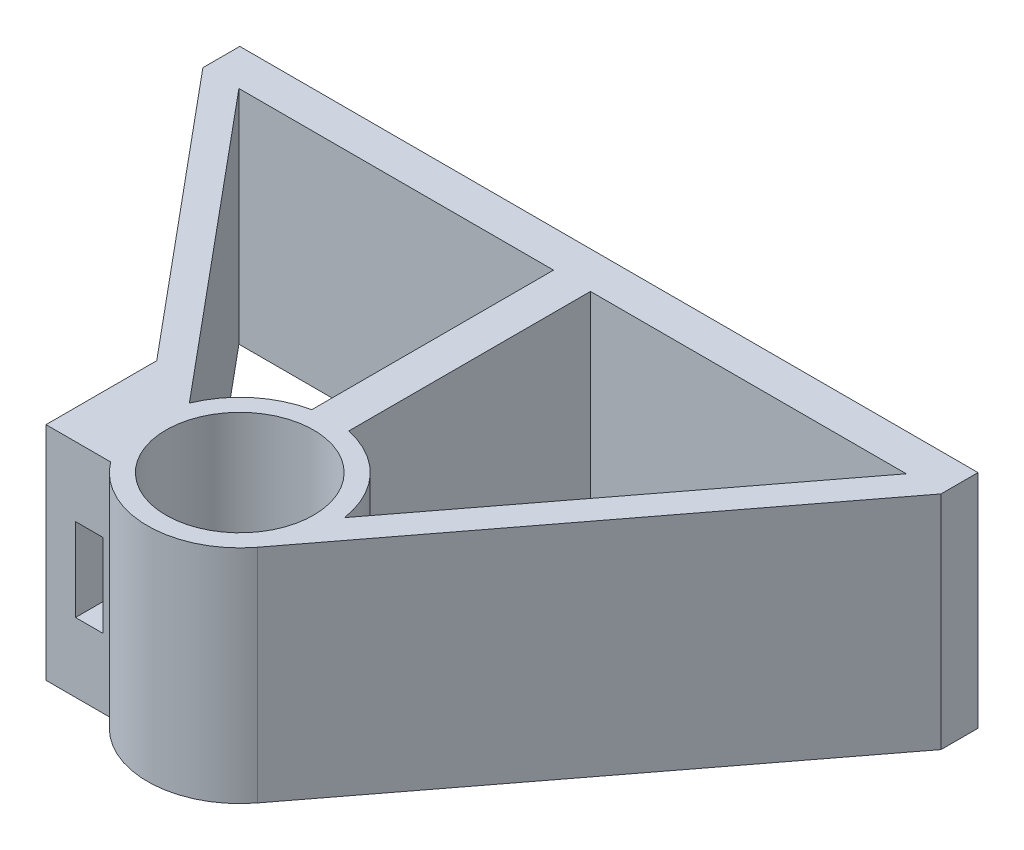
ISO-10303-21;
HEADER;
FILE_DESCRIPTION(('STEP AP214'),'2;1');
FILE_NAME('part.step','',(''),(''),'','','');
FILE_SCHEMA(('AUTOMOTIVE_DESIGN { 1 0 10303 214 1 1 1 1 }'));
ENDSEC;
DATA;
#1=APPLICATION_CONTEXT('core data for automotive mechanical design processes');
#2=APPLICATION_PROTOCOL_DEFINITION('international standard','automotive_design',2000,#1);
#3=PRODUCT_CONTEXT('',#1,'mechanical');
#4=PRODUCT('Part','Part','',(#3));
#5=PRODUCT_RELATED_PRODUCT_CATEGORY('part','',(#4));
#6=PRODUCT_DEFINITION_FORMATION('','',#4);
#7=PRODUCT_DEFINITION_CONTEXT('part definition',#1,'design');
#8=PRODUCT_DEFINITION('design','',#6,#7);
#9=PRODUCT_DEFINITION_SHAPE('','',#8);
#10=(LENGTH_UNIT() NAMED_UNIT(*) SI_UNIT(.MILLI.,.METRE.));
#11=(NAMED_UNIT(*) PLANE_ANGLE_UNIT() SI_UNIT($,.RADIAN.));
#12=(NAMED_UNIT(*) SI_UNIT($,.STERADIAN.) SOLID_ANGLE_UNIT());
#13=UNCERTAINTY_MEASURE_WITH_UNIT(LENGTH_MEASURE(1.E-05),#10,'distance_accuracy_value','');
#14=(GEOMETRIC_REPRESENTATION_CONTEXT(3) GLOBAL_UNCERTAINTY_ASSIGNED_CONTEXT((#13)) GLOBAL_UNIT_ASSIGNED_CONTEXT((#10,
#11,#12)) REPRESENTATION_CONTEXT('',''));
#15=CARTESIAN_POINT('',(0.,0.,0.));
#16=DIRECTION('',(0.,0.,1.));
#17=DIRECTION('',(1.,0.,0.));
#18=AXIS2_PLACEMENT_3D('',#15,#16,#17);
#19=CARTESIAN_POINT('',(-4.,-6.,3.));
#20=DIRECTION('',(0.,0.,1.));
#21=DIRECTION('',(1.,0.,0.));
#22=AXIS2_PLACEMENT_3D('',#19,#20,#21);
#23=PLANE('',#22);
#24=DIRECTION('',(0.,1.,0.));
#25=VECTOR('',#24,1.);
#26=CARTESIAN_POINT('',(-4.,-6.,3.));
#27=LINE('',#26,#25);
#28=CARTESIAN_POINT('',(-4.,-6.,3.));
#29=VERTEX_POINT('',#28);
#30=CARTESIAN_POINT('',(-4.,6.,3.));
#31=VERTEX_POINT('',#30);
#32=EDGE_CURVE('E412',#29,#31,#27,.T.);
#33=ORIENTED_EDGE('',*,*,#32,.T.);
#34=DIRECTION('',(1.,0.,0.));
#35=VECTOR('',#34,1.);
#36=CARTESIAN_POINT('',(-4.,6.,3.));
#37=LINE('',#36,#35);
#38=CARTESIAN_POINT('',(-7.5,6.,3.));
#39=VERTEX_POINT('',#38);
#40=EDGE_CURVE('E284',#39,#31,#37,.T.);
#41=ORIENTED_EDGE('',*,*,#40,.F.);
#42=DIRECTION('',(0.,1.,0.));
#43=VECTOR('',#42,1.);
#44=CARTESIAN_POINT('',(-7.5,-6.,3.));
#45=LINE('',#44,#43);
#46=CARTESIAN_POINT('',(-7.5,-6.,3.));
#47=VERTEX_POINT('',#46);
#48=EDGE_CURVE('E414',#47,#39,#45,.T.);
#49=ORIENTED_EDGE('',*,*,#48,.F.);
#50=DIRECTION('',(1.,0.,0.));
#51=VECTOR('',#50,1.);
#52=CARTESIAN_POINT('',(-4.,-6.,3.));
#53=LINE('',#52,#51);
#54=EDGE_CURVE('E377',#47,#29,#53,.T.);
#55=ORIENTED_EDGE('',*,*,#54,.T.);
#56=EDGE_LOOP('',(#33,#41,#49,#55));
#57=FACE_BOUND('',#56,.T.);
#58=DIRECTION('',(0.,1.,0.));
#59=VECTOR('',#58,1.);
#60=CARTESIAN_POINT('',(-5.9,2.25,3.));
#61=LINE('',#60,#59);
#62=CARTESIAN_POINT('',(-5.9,-2.25,3.));
#63=VERTEX_POINT('',#62);
#64=CARTESIAN_POINT('',(-5.9,2.25,3.));
#65=VERTEX_POINT('',#64);
#66=EDGE_CURVE('E200',#63,#65,#61,.T.);
#67=ORIENTED_EDGE('',*,*,#66,.T.);
#68=DIRECTION('',(1.,0.,0.));
#69=VECTOR('',#68,1.);
#70=CARTESIAN_POINT('',(-4.4,2.25,3.));
#71=LINE('',#70,#69);
#72=CARTESIAN_POINT('',(-4.4,2.25,3.));
#73=VERTEX_POINT('',#72);
#74=EDGE_CURVE('E57',#65,#73,#71,.T.);
#75=ORIENTED_EDGE('',*,*,#74,.T.);
#76=DIRECTION('',(0.,-1.,0.));
#77=VECTOR('',#76,1.);
#78=CARTESIAN_POINT('',(-4.4,-2.25,3.));
#79=LINE('',#78,#77);
#80=CARTESIAN_POINT('',(-4.4,-2.25,3.));
#81=VERTEX_POINT('',#80);
#82=EDGE_CURVE('E194',#73,#81,#79,.T.);
#83=ORIENTED_EDGE('',*,*,#82,.T.);
#84=DIRECTION('',(-1.,0.,0.));
#85=VECTOR('',#84,1.);
#86=CARTESIAN_POINT('',(-4.4,-2.25,3.));
#87=LINE('',#86,#85);
#88=EDGE_CURVE('E209',#81,#63,#87,.T.);
#89=ORIENTED_EDGE('',*,*,#88,.T.);
#90=EDGE_LOOP('',(#67,#75,#83,#89));
#91=FACE_BOUND('',#90,.T.);
#92=ADVANCED_FACE('F39',(#57,#91),#23,.T.);
#93=CARTESIAN_POINT('',(-18.0474375810233,-6.,-18.));
#94=DIRECTION('',(-0.768221279597376,0.,0.64018439966448));
#95=DIRECTION('',(0.64018439966448,0.,0.768221279597376));
#96=AXIS2_PLACEMENT_3D('',#93,#94,#95);
#97=PLANE('',#96);
#98=DIRECTION('',(-0.64018439966448,0.,-0.768221279597376));
#99=VECTOR('',#98,1.);
#100=CARTESIAN_POINT('',(-13.4383238183089,2.25,-12.4690634847426));
#101=LINE('',#100,#99);
#102=CARTESIAN_POINT('',(-4.62685842670751,2.25,-1.89530501482101));
#103=VERTEX_POINT('',#102);
#104=CARTESIAN_POINT('',(-5.9,2.25,-3.423074902772));
#105=VERTEX_POINT('',#104);
#106=EDGE_CURVE('E207',#103,#105,#101,.T.);
#107=ORIENTED_EDGE('',*,*,#106,.T.);
#108=DIRECTION('',(0.,-1.,0.));
#109=VECTOR('',#108,1.);
#110=CARTESIAN_POINT('',(-5.9,2.25,-3.423074902772));
#111=LINE('',#110,#109);
#112=CARTESIAN_POINT('',(-5.9,-2.25,-3.423074902772));
#113=VERTEX_POINT('',#112);
#114=EDGE_CURVE('E198',#105,#113,#111,.T.);
#115=ORIENTED_EDGE('',*,*,#114,.T.);
#116=DIRECTION('',(0.64018439966448,0.,0.768221279597376));
#117=VECTOR('',#116,1.);
#118=CARTESIAN_POINT('',(-13.4383238183089,-2.25,-12.4690634847426));
#119=LINE('',#118,#117);
#120=CARTESIAN_POINT('',(-4.62685842670751,-2.25,-1.89530501482101));
#121=VERTEX_POINT('',#120);
#122=EDGE_CURVE('E183',#113,#121,#119,.T.);
#123=ORIENTED_EDGE('',*,*,#122,.T.);
#124=DIRECTION('',(0.,1.,0.));
#125=VECTOR('',#124,1.);
#126=CARTESIAN_POINT('',(-4.62685842670751,-6.,-1.89530501482101));
#127=LINE('',#126,#125);
#128=CARTESIAN_POINT('',(-4.62685842670751,-6.,-1.89530501482101));
#129=VERTEX_POINT('',#128);
#130=EDGE_CURVE('E363',#129,#121,#127,.T.);
#131=ORIENTED_EDGE('',*,*,#130,.F.);
#132=DIRECTION('',(0.64018439966448,0.,0.768221279597376));
#133=VECTOR('',#132,1.);
#134=CARTESIAN_POINT('',(-18.0474375810233,-6.,-18.));
#135=LINE('',#134,#133);
#136=CARTESIAN_POINT('',(-18.0474375810233,-6.,-18.));
#137=VERTEX_POINT('',#136);
#138=EDGE_CURVE('E328',#137,#129,#135,.T.);
#139=ORIENTED_EDGE('',*,*,#138,.F.);
#140=DIRECTION('',(0.,1.,0.));
#141=VECTOR('',#140,1.);
#142=CARTESIAN_POINT('',(-18.0474375810233,-6.,-18.));
#143=LINE('',#142,#141);
#144=CARTESIAN_POINT('',(-18.0474375810233,6.,-18.));
#145=VERTEX_POINT('',#144);
#146=EDGE_CURVE('E353',#137,#145,#143,.T.);
#147=ORIENTED_EDGE('',*,*,#146,.T.);
#148=DIRECTION('',(0.64018439966448,0.,0.768221279597376));
#149=VECTOR('',#148,1.);
#150=CARTESIAN_POINT('',(-18.0474375810233,6.,-18.));
#151=LINE('',#150,#149);
#152=CARTESIAN_POINT('',(-4.62685842670751,6.,-1.89530501482101));
#153=VERTEX_POINT('',#152);
#154=EDGE_CURVE('E256',#145,#153,#151,.T.);
#155=ORIENTED_EDGE('',*,*,#154,.T.);
#156=EDGE_CURVE('E352',#103,#153,#127,.T.);
#157=ORIENTED_EDGE('',*,*,#156,.F.);
#158=EDGE_LOOP('',(#107,#115,#123,#131,#139,#147,#155,#157));
#159=FACE_BOUND('',#158,.T.);
#160=ADVANCED_FACE('F205',(#159),#97,.F.);
#161=CARTESIAN_POINT('',(0.,-6.,0.));
#162=DIRECTION('',(0.,1.,0.));
#163=DIRECTION('',(0.,0.,1.));
#164=AXIS2_PLACEMENT_3D('',#161,#162,#163);
#165=CYLINDRICAL_SURFACE('',#164,5.);
#166=CARTESIAN_POINT('',(0.,2.25,0.));
#167=DIRECTION('',(0.,-1.,0.));
#168=DIRECTION('',(0.,0.,-1.));
#169=AXIS2_PLACEMENT_3D('',#166,#167,#168);
#170=CIRCLE('',#169,5.);
#171=CARTESIAN_POINT('',(-4.4,2.25,-2.37486841740758));
#172=VERTEX_POINT('',#171);
#173=EDGE_CURVE('E226',#172,#103,#170,.F.);
#174=ORIENTED_EDGE('',*,*,#173,.T.);
#175=ORIENTED_EDGE('',*,*,#156,.T.);
#176=CARTESIAN_POINT('',(0.,6.,0.));
#177=DIRECTION('',(0.,-1.,0.));
#178=DIRECTION('',(0.,0.,1.));
#179=AXIS2_PLACEMENT_3D('',#176,#177,#178);
#180=CIRCLE('',#179,5.);
#181=CARTESIAN_POINT('',(-0.999999999999997,6.,-4.89897948556636));
#182=VERTEX_POINT('',#181);
#183=EDGE_CURVE('E260',#153,#182,#180,.T.);
#184=ORIENTED_EDGE('',*,*,#183,.T.);
#185=DIRECTION('',(0.,1.,0.));
#186=VECTOR('',#185,1.);
#187=CARTESIAN_POINT('',(-0.999999999999997,-6.,-4.89897948556636));
#188=LINE('',#187,#186);
#189=CARTESIAN_POINT('',(-0.999999999999996,-6.,-4.89897948556636));
#190=VERTEX_POINT('',#189);
#191=EDGE_CURVE('E360',#190,#182,#188,.T.);
#192=ORIENTED_EDGE('',*,*,#191,.F.);
#193=CARTESIAN_POINT('',(0.,-6.,0.));
#194=DIRECTION('',(0.,-1.,0.));
#195=DIRECTION('',(0.,0.,1.));
#196=AXIS2_PLACEMENT_3D('',#193,#194,#195);
#197=CIRCLE('',#196,5.);
#198=EDGE_CURVE('E340',#129,#190,#197,.T.);
#199=ORIENTED_EDGE('',*,*,#198,.F.);
#200=ORIENTED_EDGE('',*,*,#130,.T.);
#201=CARTESIAN_POINT('',(0.,-2.25,0.));
#202=DIRECTION('',(0.,1.,0.));
#203=DIRECTION('',(0.,0.,1.));
#204=AXIS2_PLACEMENT_3D('',#201,#202,#203);
#205=CIRCLE('',#204,5.);
#206=CARTESIAN_POINT('',(-4.4,-2.25,-2.37486841740758));
#207=VERTEX_POINT('',#206);
#208=EDGE_CURVE('E189',#121,#207,#205,.F.);
#209=ORIENTED_EDGE('',*,*,#208,.T.);
#210=DIRECTION('',(0.,1.,0.));
#211=VECTOR('',#210,1.);
#212=CARTESIAN_POINT('',(-4.4,-6.,-2.37486841740758));
#213=LINE('',#212,#211);
#214=EDGE_CURVE('E224',#207,#172,#213,.T.);
#215=ORIENTED_EDGE('',*,*,#214,.T.);
#216=EDGE_LOOP('',(#174,#175,#184,#192,#199,#200,#209,#215));
#217=FACE_BOUND('',#216,.T.);
#218=ADVANCED_FACE('F466',(#217),#165,.T.);
#219=CARTESIAN_POINT('',(-20.,-6.,-18.));
#220=DIRECTION('',(-0.768221279597376,0.,0.64018439966448));
#221=DIRECTION('',(0.64018439966448,0.,0.768221279597376));
#222=AXIS2_PLACEMENT_3D('',#219,#220,#221);
#223=PLANE('',#222);
#224=DIRECTION('',(0.,1.,0.));
#225=VECTOR('',#224,1.);
#226=CARTESIAN_POINT('',(-7.5,-6.,-3.));
#227=LINE('',#226,#225);
#228=CARTESIAN_POINT('',(-7.5,-6.,-3.));
#229=VERTEX_POINT('',#228);
#230=CARTESIAN_POINT('',(-7.5,6.,-3.));
#231=VERTEX_POINT('',#230);
#232=EDGE_CURVE('E43',#229,#231,#227,.T.);
#233=ORIENTED_EDGE('',*,*,#232,.T.);
#234=DIRECTION('',(0.64018439966448,0.,0.768221279597376));
#235=VECTOR('',#234,1.);
#236=CARTESIAN_POINT('',(-20.,6.,-18.));
#237=LINE('',#236,#235);
#238=CARTESIAN_POINT('',(-20.,6.,-18.));
#239=VERTEX_POINT('',#238);
#240=EDGE_CURVE('E276',#239,#231,#237,.T.);
#241=ORIENTED_EDGE('',*,*,#240,.F.);
#242=DIRECTION('',(0.,1.,0.));
#243=VECTOR('',#242,1.);
#244=CARTESIAN_POINT('',(-20.,-6.,-18.));
#245=LINE('',#244,#243);
#246=CARTESIAN_POINT('',(-20.,-6.,-18.));
#247=VERTEX_POINT('',#246);
#248=EDGE_CURVE('E11',#247,#239,#245,.T.);
#249=ORIENTED_EDGE('',*,*,#248,.F.);
#250=DIRECTION('',(0.64018439966448,0.,0.768221279597376));
#251=VECTOR('',#250,1.);
#252=CARTESIAN_POINT('',(-20.,-6.,-18.));
#253=LINE('',#252,#251);
#254=EDGE_CURVE('E369',#247,#229,#253,.T.);
#255=ORIENTED_EDGE('',*,*,#254,.T.);
#256=EDGE_LOOP('',(#233,#241,#249,#255));
#257=FACE_BOUND('',#256,.T.);
#258=ADVANCED_FACE('F41',(#257),#223,.T.);
#259=CARTESIAN_POINT('',(-20.,-6.,-20.));
#260=DIRECTION('',(-1.,0.,0.));
#261=DIRECTION('',(0.,0.,1.));
#262=AXIS2_PLACEMENT_3D('',#259,#260,#261);
#263=PLANE('',#262);
#264=ORIENTED_EDGE('',*,*,#248,.T.);
#265=DIRECTION('',(0.,0.,1.));
#266=VECTOR('',#265,1.);
#267=CARTESIAN_POINT('',(-20.,6.,-20.));
#268=LINE('',#267,#266);
#269=CARTESIAN_POINT('',(-20.,6.,-20.));
#270=VERTEX_POINT('',#269);
#271=EDGE_CURVE('E304',#270,#239,#268,.T.);
#272=ORIENTED_EDGE('',*,*,#271,.F.);
#273=DIRECTION('',(0.,1.,0.));
#274=VECTOR('',#273,1.);
#275=CARTESIAN_POINT('',(-20.,-6.,-20.));
#276=LINE('',#275,#274);
#277=CARTESIAN_POINT('',(-20.,-6.,-20.));
#278=VERTEX_POINT('',#277);
#279=EDGE_CURVE('E49',#278,#270,#276,.T.);
#280=ORIENTED_EDGE('',*,*,#279,.F.);
#281=DIRECTION('',(0.,0.,1.));
#282=VECTOR('',#281,1.);
#283=CARTESIAN_POINT('',(-20.,-6.,-20.));
#284=LINE('',#283,#282);
#285=EDGE_CURVE('E397',#278,#247,#284,.T.);
#286=ORIENTED_EDGE('',*,*,#285,.T.);
#287=EDGE_LOOP('',(#264,#272,#280,#286));
#288=FACE_BOUND('',#287,.T.);
#289=ADVANCED_FACE('F431',(#288),#263,.T.);
#290=CARTESIAN_POINT('',(20.,-6.,-20.));
#291=DIRECTION('',(0.,0.,-1.));
#292=DIRECTION('',(-1.,0.,0.));
#293=AXIS2_PLACEMENT_3D('',#290,#291,#292);
#294=PLANE('',#293);
#295=ORIENTED_EDGE('',*,*,#279,.T.);
#296=DIRECTION('',(-1.,0.,0.));
#297=VECTOR('',#296,1.);
#298=CARTESIAN_POINT('',(20.,6.,-20.));
#299=LINE('',#298,#297);
#300=CARTESIAN_POINT('',(20.,6.,-20.));
#301=VERTEX_POINT('',#300);
#302=EDGE_CURVE('E300',#301,#270,#299,.T.);
#303=ORIENTED_EDGE('',*,*,#302,.F.);
#304=DIRECTION('',(0.,1.,0.));
#305=VECTOR('',#304,1.);
#306=CARTESIAN_POINT('',(20.,-6.,-20.));
#307=LINE('',#306,#305);
#308=CARTESIAN_POINT('',(20.,-6.,-20.));
#309=VERTEX_POINT('',#308);
#310=EDGE_CURVE('E403',#309,#301,#307,.T.);
#311=ORIENTED_EDGE('',*,*,#310,.F.);
#312=DIRECTION('',(-1.,0.,0.));
#313=VECTOR('',#312,1.);
#314=CARTESIAN_POINT('',(20.,-6.,-20.));
#315=LINE('',#314,#313);
#316=EDGE_CURVE('E393',#309,#278,#315,.T.);
#317=ORIENTED_EDGE('',*,*,#316,.T.);
#318=EDGE_LOOP('',(#295,#303,#311,#317));
#319=FACE_BOUND('',#318,.T.);
#320=ADVANCED_FACE('F452',(#319),#294,.T.);
#321=CARTESIAN_POINT('',(20.,-6.,-20.));
#322=DIRECTION('',(1.,0.,0.));
#323=DIRECTION('',(0.,0.,-1.));
#324=AXIS2_PLACEMENT_3D('',#321,#322,#323);
#325=PLANE('',#324);
#326=ORIENTED_EDGE('',*,*,#310,.T.);
#327=DIRECTION('',(0.,0.,-1.));
#328=VECTOR('',#327,1.);
#329=CARTESIAN_POINT('',(20.,6.,-20.));
#330=LINE('',#329,#328);
#331=CARTESIAN_POINT('',(20.,6.,-18.));
#332=VERTEX_POINT('',#331);
#333=EDGE_CURVE('E296',#332,#301,#330,.T.);
#334=ORIENTED_EDGE('',*,*,#333,.F.);
#335=DIRECTION('',(0.,1.,0.));
#336=VECTOR('',#335,1.);
#337=CARTESIAN_POINT('',(20.,-6.,-18.));
#338=LINE('',#337,#336);
#339=CARTESIAN_POINT('',(20.,-6.,-18.));
#340=VERTEX_POINT('',#339);
#341=EDGE_CURVE('E406',#340,#332,#338,.T.);
#342=ORIENTED_EDGE('',*,*,#341,.F.);
#343=DIRECTION('',(0.,0.,-1.));
#344=VECTOR('',#343,1.);
#345=CARTESIAN_POINT('',(20.,-6.,-20.));
#346=LINE('',#345,#344);
#347=EDGE_CURVE('E389',#340,#309,#346,.T.);
#348=ORIENTED_EDGE('',*,*,#347,.T.);
#349=EDGE_LOOP('',(#326,#334,#342,#348));
#350=FACE_BOUND('',#349,.T.);
#351=ADVANCED_FACE('F449',(#350),#325,.T.);
#352=CARTESIAN_POINT('',(20.,-6.,-18.));
#353=DIRECTION('',(0.795435008826633,0.,0.606038898696259));
#354=DIRECTION('',(0.606038898696259,0.,-0.795435008826633));
#355=AXIS2_PLACEMENT_3D('',#352,#353,#354);
#356=PLANE('',#355);
#357=ORIENTED_EDGE('',*,*,#341,.T.);
#358=DIRECTION('',(0.606038898696259,0.,-0.795435008826633));
#359=VECTOR('',#358,1.);
#360=CARTESIAN_POINT('',(20.,6.,-18.));
#361=LINE('',#360,#359);
#362=CARTESIAN_POINT('',(3.97717504413316,6.,3.03019449348129));
#363=VERTEX_POINT('',#362);
#364=EDGE_CURVE('E292',#363,#332,#361,.T.);
#365=ORIENTED_EDGE('',*,*,#364,.F.);
#366=DIRECTION('',(0.,1.,0.));
#367=VECTOR('',#366,1.);
#368=CARTESIAN_POINT('',(3.97717504413316,-6.,3.03019449348129));
#369=LINE('',#368,#367);
#370=CARTESIAN_POINT('',(3.97717504413316,-6.,3.03019449348129));
#371=VERTEX_POINT('',#370);
#372=EDGE_CURVE('E409',#371,#363,#369,.T.);
#373=ORIENTED_EDGE('',*,*,#372,.F.);
#374=DIRECTION('',(0.606038898696259,0.,-0.795435008826633));
#375=VECTOR('',#374,1.);
#376=CARTESIAN_POINT('',(20.,-6.,-18.));
#377=LINE('',#376,#375);
#378=EDGE_CURVE('E385',#371,#340,#377,.T.);
#379=ORIENTED_EDGE('',*,*,#378,.T.);
#380=EDGE_LOOP('',(#357,#365,#373,#379));
#381=FACE_BOUND('',#380,.T.);
#382=ADVANCED_FACE('F446',(#381),#356,.T.);
#383=CARTESIAN_POINT('',(0.,-6.,0.));
#384=DIRECTION('',(0.,1.,0.));
#385=DIRECTION('',(0.,0.,1.));
#386=AXIS2_PLACEMENT_3D('',#383,#384,#385);
#387=CYLINDRICAL_SURFACE('',#386,5.);
#388=ORIENTED_EDGE('',*,*,#372,.T.);
#389=CARTESIAN_POINT('',(0.,6.,0.));
#390=DIRECTION('',(0.,1.,0.));
#391=DIRECTION('',(0.,0.,1.));
#392=AXIS2_PLACEMENT_3D('',#389,#390,#391);
#393=CIRCLE('',#392,5.);
#394=EDGE_CURVE('E288',#31,#363,#393,.T.);
#395=ORIENTED_EDGE('',*,*,#394,.F.);
#396=ORIENTED_EDGE('',*,*,#32,.F.);
#397=CARTESIAN_POINT('',(0.,-6.,0.));
#398=DIRECTION('',(0.,1.,0.));
#399=DIRECTION('',(0.,0.,1.));
#400=AXIS2_PLACEMENT_3D('',#397,#398,#399);
#401=CIRCLE('',#400,5.);
#402=EDGE_CURVE('E381',#29,#371,#401,.T.);
#403=ORIENTED_EDGE('',*,*,#402,.T.);
#404=EDGE_LOOP('',(#388,#395,#396,#403));
#405=FACE_BOUND('',#404,.T.);
#406=ADVANCED_FACE('F444',(#405),#387,.T.);
#407=CARTESIAN_POINT('',(-7.5,-6.,-3.));
#408=DIRECTION('',(-1.,0.,0.));
#409=DIRECTION('',(0.,0.,1.));
#410=AXIS2_PLACEMENT_3D('',#407,#408,#409);
#411=PLANE('',#410);
#412=ORIENTED_EDGE('',*,*,#48,.T.);
#413=DIRECTION('',(0.,0.,1.));
#414=VECTOR('',#413,1.);
#415=CARTESIAN_POINT('',(-7.5,6.,-3.));
#416=LINE('',#415,#414);
#417=EDGE_CURVE('E280',#231,#39,#416,.T.);
#418=ORIENTED_EDGE('',*,*,#417,.F.);
#419=ORIENTED_EDGE('',*,*,#232,.F.);
#420=DIRECTION('',(0.,0.,1.));
#421=VECTOR('',#420,1.);
#422=CARTESIAN_POINT('',(-7.5,-6.,-3.));
#423=LINE('',#422,#421);
#424=EDGE_CURVE('E373',#229,#47,#423,.T.);
#425=ORIENTED_EDGE('',*,*,#424,.T.);
#426=EDGE_LOOP('',(#412,#418,#419,#425));
#427=FACE_BOUND('',#426,.T.);
#428=ADVANCED_FACE('F423',(#427),#411,.T.);
#429=CARTESIAN_POINT('',(0.,-6.,0.));
#430=DIRECTION('',(0.,1.,0.));
#431=DIRECTION('',(0.,0.,1.));
#432=AXIS2_PLACEMENT_3D('',#429,#430,#431);
#433=PLANE('',#432);
#434=DIRECTION('',(0.,0.,1.));
#435=VECTOR('',#434,1.);
#436=CARTESIAN_POINT('',(1.,-6.,-4.89897948556636));
#437=LINE('',#436,#435);
#438=CARTESIAN_POINT('',(1.,-6.,-18.));
#439=VERTEX_POINT('',#438);
#440=CARTESIAN_POINT('',(1.,-6.,-4.89897948556636));
#441=VERTEX_POINT('',#440);
#442=EDGE_CURVE('E320',#439,#441,#437,.T.);
#443=ORIENTED_EDGE('',*,*,#442,.T.);
#444=CARTESIAN_POINT('',(0.,-6.,0.));
#445=DIRECTION('',(0.,-1.,0.));
#446=DIRECTION('',(0.,0.,1.));
#447=AXIS2_PLACEMENT_3D('',#444,#445,#446);
#448=CIRCLE('',#447,5.);
#449=CARTESIAN_POINT('',(4.94801424086935,-6.,-0.719134947109471));
#450=VERTEX_POINT('',#449);
#451=EDGE_CURVE('E308',#441,#450,#448,.T.);
#452=ORIENTED_EDGE('',*,*,#451,.T.);
#453=DIRECTION('',(0.606038898696259,0.,-0.795435008826633));
#454=VECTOR('',#453,1.);
#455=CARTESIAN_POINT('',(18.1142393993789,-6.,-18.));
#456=LINE('',#455,#454);
#457=CARTESIAN_POINT('',(18.1142393993789,-6.,-18.));
#458=VERTEX_POINT('',#457);
#459=EDGE_CURVE('E312',#450,#458,#456,.T.);
#460=ORIENTED_EDGE('',*,*,#459,.T.);
#461=DIRECTION('',(-1.,0.,0.));
#462=VECTOR('',#461,1.);
#463=CARTESIAN_POINT('',(1.,-6.,-18.));
#464=LINE('',#463,#462);
#465=EDGE_CURVE('E316',#458,#439,#464,.T.);
#466=ORIENTED_EDGE('',*,*,#465,.T.);
#467=EDGE_LOOP('',(#443,#452,#460,#466));
#468=FACE_BOUND('',#467,.T.);
#469=DIRECTION('',(-1.,0.,0.));
#470=VECTOR('',#469,1.);
#471=CARTESIAN_POINT('',(-18.0474375810233,-6.,-18.));
#472=LINE('',#471,#470);
#473=CARTESIAN_POINT('',(-1.,-6.,-18.));
#474=VERTEX_POINT('',#473);
#475=EDGE_CURVE('E348',#474,#137,#472,.T.);
#476=ORIENTED_EDGE('',*,*,#475,.T.);
#477=ORIENTED_EDGE('',*,*,#138,.T.);
#478=ORIENTED_EDGE('',*,*,#198,.T.);
#479=DIRECTION('',(0.,0.,-1.));
#480=VECTOR('',#479,1.);
#481=CARTESIAN_POINT('',(-1.,-6.,-18.));
#482=LINE('',#481,#480);
#483=EDGE_CURVE('E344',#190,#474,#482,.T.);
#484=ORIENTED_EDGE('',*,*,#483,.T.);
#485=EDGE_LOOP('',(#476,#477,#478,#484));
#486=FACE_BOUND('',#485,.T.);
#487=CARTESIAN_POINT('',(0.,-6.,0.));
#488=DIRECTION('',(0.,1.,0.));
#489=DIRECTION('',(0.,0.,1.));
#490=AXIS2_PLACEMENT_3D('',#487,#488,#489);
#491=CIRCLE('',#490,4.);
#492=CARTESIAN_POINT('',(0.,-6.,4.));
#493=VERTEX_POINT('',#492);
#494=EDGE_CURVE('E356',#493,#493,#491,.T.);
#495=ORIENTED_EDGE('',*,*,#494,.T.);
#496=EDGE_LOOP('',(#495));
#497=FACE_BOUND('',#496,.T.);
#498=ORIENTED_EDGE('',*,*,#254,.F.);
#499=ORIENTED_EDGE('',*,*,#285,.F.);
#500=ORIENTED_EDGE('',*,*,#316,.F.);
#501=ORIENTED_EDGE('',*,*,#347,.F.);
#502=ORIENTED_EDGE('',*,*,#378,.F.);
#503=ORIENTED_EDGE('',*,*,#402,.F.);
#504=ORIENTED_EDGE('',*,*,#54,.F.);
#505=ORIENTED_EDGE('',*,*,#424,.F.);
#506=EDGE_LOOP('',(#498,#499,#500,#501,#502,#503,#504,#505));
#507=FACE_BOUND('',#506,.T.);
#508=ADVANCED_FACE('F434',(#468,#486,#497,#507),#433,.F.);
#509=CARTESIAN_POINT('',(0.,-6.,0.));
#510=DIRECTION('',(0.,1.,0.));
#511=DIRECTION('',(0.,0.,1.));
#512=AXIS2_PLACEMENT_3D('',#509,#510,#511);
#513=CYLINDRICAL_SURFACE('',#512,4.);
#514=ORIENTED_EDGE('',*,*,#494,.F.);
#515=EDGE_LOOP('',(#514));
#516=FACE_BOUND('',#515,.T.);
#517=CARTESIAN_POINT('',(0.,6.,0.));
#518=DIRECTION('',(0.,1.,0.));
#519=DIRECTION('',(0.,0.,1.));
#520=AXIS2_PLACEMENT_3D('',#517,#518,#519);
#521=CIRCLE('',#520,4.);
#522=CARTESIAN_POINT('',(0.,6.,4.));
#523=VERTEX_POINT('',#522);
#524=EDGE_CURVE('E272',#523,#523,#521,.T.);
#525=ORIENTED_EDGE('',*,*,#524,.T.);
#526=EDGE_LOOP('',(#525));
#527=FACE_BOUND('',#526,.T.);
#528=ADVANCED_FACE('F475',(#516,#527),#513,.F.);
#529=CARTESIAN_POINT('',(-18.0474375810233,-6.,-18.));
#530=DIRECTION('',(0.,0.,-1.));
#531=DIRECTION('',(-1.,0.,0.));
#532=AXIS2_PLACEMENT_3D('',#529,#530,#531);
#533=PLANE('',#532);
#534=DIRECTION('',(0.,1.,0.));
#535=VECTOR('',#534,1.);
#536=CARTESIAN_POINT('',(-1.,-6.,-18.));
#537=LINE('',#536,#535);
#538=CARTESIAN_POINT('',(-1.,6.,-18.));
#539=VERTEX_POINT('',#538);
#540=EDGE_CURVE('E357',#474,#539,#537,.T.);
#541=ORIENTED_EDGE('',*,*,#540,.T.);
#542=DIRECTION('',(-1.,0.,0.));
#543=VECTOR('',#542,1.);
#544=CARTESIAN_POINT('',(-18.0474375810233,6.,-18.));
#545=LINE('',#544,#543);
#546=EDGE_CURVE('E268',#539,#145,#545,.T.);
#547=ORIENTED_EDGE('',*,*,#546,.T.);
#548=ORIENTED_EDGE('',*,*,#146,.F.);
#549=ORIENTED_EDGE('',*,*,#475,.F.);
#550=EDGE_LOOP('',(#541,#547,#548,#549));
#551=FACE_BOUND('',#550,.T.);
#552=ADVANCED_FACE('F584',(#551),#533,.F.);
#553=CARTESIAN_POINT('',(-1.,-6.,-18.));
#554=DIRECTION('',(1.,0.,0.));
#555=DIRECTION('',(0.,0.,-1.));
#556=AXIS2_PLACEMENT_3D('',#553,#554,#555);
#557=PLANE('',#556);
#558=ORIENTED_EDGE('',*,*,#191,.T.);
#559=DIRECTION('',(0.,0.,-1.));
#560=VECTOR('',#559,1.);
#561=CARTESIAN_POINT('',(-1.,6.,-18.));
#562=LINE('',#561,#560);
#563=EDGE_CURVE('E264',#182,#539,#562,.T.);
#564=ORIENTED_EDGE('',*,*,#563,.T.);
#565=ORIENTED_EDGE('',*,*,#540,.F.);
#566=ORIENTED_EDGE('',*,*,#483,.F.);
#567=EDGE_LOOP('',(#558,#564,#565,#566));
#568=FACE_BOUND('',#567,.T.);
#569=ADVANCED_FACE('F574',(#568),#557,.F.);
#570=CARTESIAN_POINT('',(0.,-6.,0.));
#571=DIRECTION('',(0.,1.,0.));
#572=DIRECTION('',(0.,0.,1.));
#573=AXIS2_PLACEMENT_3D('',#570,#571,#572);
#574=CYLINDRICAL_SURFACE('',#573,5.);
#575=DIRECTION('',(0.,1.,0.));
#576=VECTOR('',#575,1.);
#577=CARTESIAN_POINT('',(1.,-6.,-4.89897948556636));
#578=LINE('',#577,#576);
#579=CARTESIAN_POINT('',(1.,6.,-4.89897948556636));
#580=VERTEX_POINT('',#579);
#581=EDGE_CURVE('E325',#441,#580,#578,.T.);
#582=ORIENTED_EDGE('',*,*,#581,.T.);
#583=CARTESIAN_POINT('',(0.,6.,0.));
#584=DIRECTION('',(0.,-1.,0.));
#585=DIRECTION('',(0.,0.,1.));
#586=AXIS2_PLACEMENT_3D('',#583,#584,#585);
#587=CIRCLE('',#586,5.);
#588=CARTESIAN_POINT('',(4.94801424086935,6.,-0.719134947109471));
#589=VERTEX_POINT('',#588);
#590=EDGE_CURVE('E216',#580,#589,#587,.T.);
#591=ORIENTED_EDGE('',*,*,#590,.T.);
#592=DIRECTION('',(0.,1.,0.));
#593=VECTOR('',#592,1.);
#594=CARTESIAN_POINT('',(4.94801424086935,-6.,-0.719134947109471));
#595=LINE('',#594,#593);
#596=EDGE_CURVE('E324',#450,#589,#595,.T.);
#597=ORIENTED_EDGE('',*,*,#596,.F.);
#598=ORIENTED_EDGE('',*,*,#451,.F.);
#599=EDGE_LOOP('',(#582,#591,#597,#598));
#600=FACE_BOUND('',#599,.T.);
#601=ADVANCED_FACE('F564',(#600),#574,.T.);
#602=CARTESIAN_POINT('',(1.,-6.,-4.89897948556636));
#603=DIRECTION('',(-1.,0.,0.));
#604=DIRECTION('',(0.,0.,1.));
#605=AXIS2_PLACEMENT_3D('',#602,#603,#604);
#606=PLANE('',#605);
#607=DIRECTION('',(0.,1.,0.));
#608=VECTOR('',#607,1.);
#609=CARTESIAN_POINT('',(1.,-6.,-18.));
#610=LINE('',#609,#608);
#611=CARTESIAN_POINT('',(1.,6.,-18.));
#612=VERTEX_POINT('',#611);
#613=EDGE_CURVE('E329',#439,#612,#610,.T.);
#614=ORIENTED_EDGE('',*,*,#613,.T.);
#615=DIRECTION('',(0.,0.,1.));
#616=VECTOR('',#615,1.);
#617=CARTESIAN_POINT('',(1.,6.,-4.89897948556636));
#618=LINE('',#617,#616);
#619=EDGE_CURVE('E252',#612,#580,#618,.T.);
#620=ORIENTED_EDGE('',*,*,#619,.T.);
#621=ORIENTED_EDGE('',*,*,#581,.F.);
#622=ORIENTED_EDGE('',*,*,#442,.F.);
#623=EDGE_LOOP('',(#614,#620,#621,#622));
#624=FACE_BOUND('',#623,.T.);
#625=ADVANCED_FACE('F554',(#624),#606,.F.);
#626=CARTESIAN_POINT('',(1.,-6.,-18.));
#627=DIRECTION('',(0.,0.,-1.));
#628=DIRECTION('',(-1.,0.,0.));
#629=AXIS2_PLACEMENT_3D('',#626,#627,#628);
#630=PLANE('',#629);
#631=DIRECTION('',(0.,1.,0.));
#632=VECTOR('',#631,1.);
#633=CARTESIAN_POINT('',(18.1142393993789,-6.,-18.));
#634=LINE('',#633,#632);
#635=CARTESIAN_POINT('',(18.1142393993789,6.,-18.));
#636=VERTEX_POINT('',#635);
#637=EDGE_CURVE('E332',#458,#636,#634,.T.);
#638=ORIENTED_EDGE('',*,*,#637,.T.);
#639=DIRECTION('',(-1.,0.,0.));
#640=VECTOR('',#639,1.);
#641=CARTESIAN_POINT('',(1.,6.,-18.));
#642=LINE('',#641,#640);
#643=EDGE_CURVE('E248',#636,#612,#642,.T.);
#644=ORIENTED_EDGE('',*,*,#643,.T.);
#645=ORIENTED_EDGE('',*,*,#613,.F.);
#646=ORIENTED_EDGE('',*,*,#465,.F.);
#647=EDGE_LOOP('',(#638,#644,#645,#646));
#648=FACE_BOUND('',#647,.T.);
#649=ADVANCED_FACE('F544',(#648),#630,.F.);
#650=CARTESIAN_POINT('',(18.1142393993789,-6.,-18.));
#651=DIRECTION('',(0.795435008826633,0.,0.606038898696259));
#652=DIRECTION('',(0.606038898696259,0.,-0.795435008826633));
#653=AXIS2_PLACEMENT_3D('',#650,#651,#652);
#654=PLANE('',#653);
#655=ORIENTED_EDGE('',*,*,#596,.T.);
#656=DIRECTION('',(0.606038898696259,0.,-0.795435008826633));
#657=VECTOR('',#656,1.);
#658=CARTESIAN_POINT('',(18.1142393993789,6.,-18.));
#659=LINE('',#658,#657);
#660=EDGE_CURVE('E244',#589,#636,#659,.T.);
#661=ORIENTED_EDGE('',*,*,#660,.T.);
#662=ORIENTED_EDGE('',*,*,#637,.F.);
#663=ORIENTED_EDGE('',*,*,#459,.F.);
#664=EDGE_LOOP('',(#655,#661,#662,#663));
#665=FACE_BOUND('',#664,.T.);
#666=ADVANCED_FACE('F533',(#665),#654,.F.);
#667=CARTESIAN_POINT('',(0.,6.,0.));
#668=DIRECTION('',(0.,1.,0.));
#669=DIRECTION('',(0.,0.,1.));
#670=AXIS2_PLACEMENT_3D('',#667,#668,#669);
#671=PLANE('',#670);
#672=ORIENTED_EDGE('',*,*,#240,.T.);
#673=ORIENTED_EDGE('',*,*,#417,.T.);
#674=ORIENTED_EDGE('',*,*,#40,.T.);
#675=ORIENTED_EDGE('',*,*,#394,.T.);
#676=ORIENTED_EDGE('',*,*,#364,.T.);
#677=ORIENTED_EDGE('',*,*,#333,.T.);
#678=ORIENTED_EDGE('',*,*,#302,.T.);
#679=ORIENTED_EDGE('',*,*,#271,.T.);
#680=EDGE_LOOP('',(#672,#673,#674,#675,#676,#677,#678,#679));
#681=FACE_BOUND('',#680,.T.);
#682=ORIENTED_EDGE('',*,*,#524,.F.);
#683=EDGE_LOOP('',(#682));
#684=FACE_BOUND('',#683,.T.);
#685=ORIENTED_EDGE('',*,*,#183,.F.);
#686=ORIENTED_EDGE('',*,*,#154,.F.);
#687=ORIENTED_EDGE('',*,*,#546,.F.);
#688=ORIENTED_EDGE('',*,*,#563,.F.);
#689=EDGE_LOOP('',(#685,#686,#687,#688));
#690=FACE_BOUND('',#689,.T.);
#691=ORIENTED_EDGE('',*,*,#660,.F.);
#692=ORIENTED_EDGE('',*,*,#590,.F.);
#693=ORIENTED_EDGE('',*,*,#619,.F.);
#694=ORIENTED_EDGE('',*,*,#643,.F.);
#695=EDGE_LOOP('',(#691,#692,#693,#694));
#696=FACE_BOUND('',#695,.T.);
#697=ADVANCED_FACE('F426',(#681,#684,#690,#696),#671,.T.);
#698=CARTESIAN_POINT('',(-4.4,2.25,-20.001));
#699=DIRECTION('',(0.,-1.,0.));
#700=DIRECTION('',(0.,0.,-1.));
#701=AXIS2_PLACEMENT_3D('',#698,#699,#700);
#702=PLANE('',#701);
#703=ORIENTED_EDGE('',*,*,#173,.F.);
#704=DIRECTION('',(0.,0.,1.));
#705=VECTOR('',#704,1.);
#706=CARTESIAN_POINT('',(-4.4,2.25,-20.001));
#707=LINE('',#706,#705);
#708=EDGE_CURVE('E221',#172,#73,#707,.T.);
#709=ORIENTED_EDGE('',*,*,#708,.T.);
#710=ORIENTED_EDGE('',*,*,#74,.F.);
#711=DIRECTION('',(0.,0.,1.));
#712=VECTOR('',#711,1.);
#713=CARTESIAN_POINT('',(-5.9,2.25,-20.001));
#714=LINE('',#713,#712);
#715=EDGE_CURVE('E225',#105,#65,#714,.T.);
#716=ORIENTED_EDGE('',*,*,#715,.F.);
#717=ORIENTED_EDGE('',*,*,#106,.F.);
#718=EDGE_LOOP('',(#703,#709,#710,#716,#717));
#719=FACE_BOUND('',#718,.T.);
#720=ADVANCED_FACE('F532',(#719),#702,.T.);
#721=CARTESIAN_POINT('',(-4.4,-2.25,-20.001));
#722=DIRECTION('',(-1.,0.,0.));
#723=DIRECTION('',(0.,0.,1.));
#724=AXIS2_PLACEMENT_3D('',#721,#722,#723);
#725=PLANE('',#724);
#726=DIRECTION('',(0.,0.,1.));
#727=VECTOR('',#726,1.);
#728=CARTESIAN_POINT('',(-4.4,-2.25,-20.001));
#729=LINE('',#728,#727);
#730=EDGE_CURVE('E65',#207,#81,#729,.T.);
#731=ORIENTED_EDGE('',*,*,#730,.T.);
#732=ORIENTED_EDGE('',*,*,#82,.F.);
#733=ORIENTED_EDGE('',*,*,#708,.F.);
#734=ORIENTED_EDGE('',*,*,#214,.F.);
#735=EDGE_LOOP('',(#731,#732,#733,#734));
#736=FACE_BOUND('',#735,.T.);
#737=ADVANCED_FACE('F630',(#736),#725,.T.);
#738=CARTESIAN_POINT('',(-4.4,-2.25,-20.001));
#739=DIRECTION('',(0.,1.,0.));
#740=DIRECTION('',(0.,0.,1.));
#741=AXIS2_PLACEMENT_3D('',#738,#739,#740);
#742=PLANE('',#741);
#743=DIRECTION('',(0.,0.,1.));
#744=VECTOR('',#743,1.);
#745=CARTESIAN_POINT('',(-5.9,-2.25,-20.001));
#746=LINE('',#745,#744);
#747=EDGE_CURVE('E186',#113,#63,#746,.T.);
#748=ORIENTED_EDGE('',*,*,#747,.T.);
#749=ORIENTED_EDGE('',*,*,#88,.F.);
#750=ORIENTED_EDGE('',*,*,#730,.F.);
#751=ORIENTED_EDGE('',*,*,#208,.F.);
#752=ORIENTED_EDGE('',*,*,#122,.F.);
#753=EDGE_LOOP('',(#748,#749,#750,#751,#752));
#754=FACE_BOUND('',#753,.T.);
#755=ADVANCED_FACE('F185',(#754),#742,.T.);
#756=CARTESIAN_POINT('',(-5.9,2.25,-20.001));
#757=DIRECTION('',(1.,0.,0.));
#758=DIRECTION('',(0.,1.,0.));
#759=AXIS2_PLACEMENT_3D('',#756,#757,#758);
#760=PLANE('',#759);
#761=ORIENTED_EDGE('',*,*,#715,.T.);
#762=ORIENTED_EDGE('',*,*,#66,.F.);
#763=ORIENTED_EDGE('',*,*,#747,.F.);
#764=ORIENTED_EDGE('',*,*,#114,.F.);
#765=EDGE_LOOP('',(#761,#762,#763,#764));
#766=FACE_BOUND('',#765,.T.);
#767=ADVANCED_FACE('F197',(#766),#760,.T.);
#768=CLOSED_SHELL('',(#92,#160,#218,#258,#289,#320,#351,#382,#406,#428,#508,#528,#552,#569,#601,
#625,#649,#666,#697,#720,#737,#755,#767));
#769=MANIFOLD_SOLID_BREP('B2',#768);
#770=ADVANCED_BREP_SHAPE_REPRESENTATION('',(#18,#769),#14);
#771=SHAPE_DEFINITION_REPRESENTATION(#9,#770);
ENDSEC;
END-ISO-10303-21;
